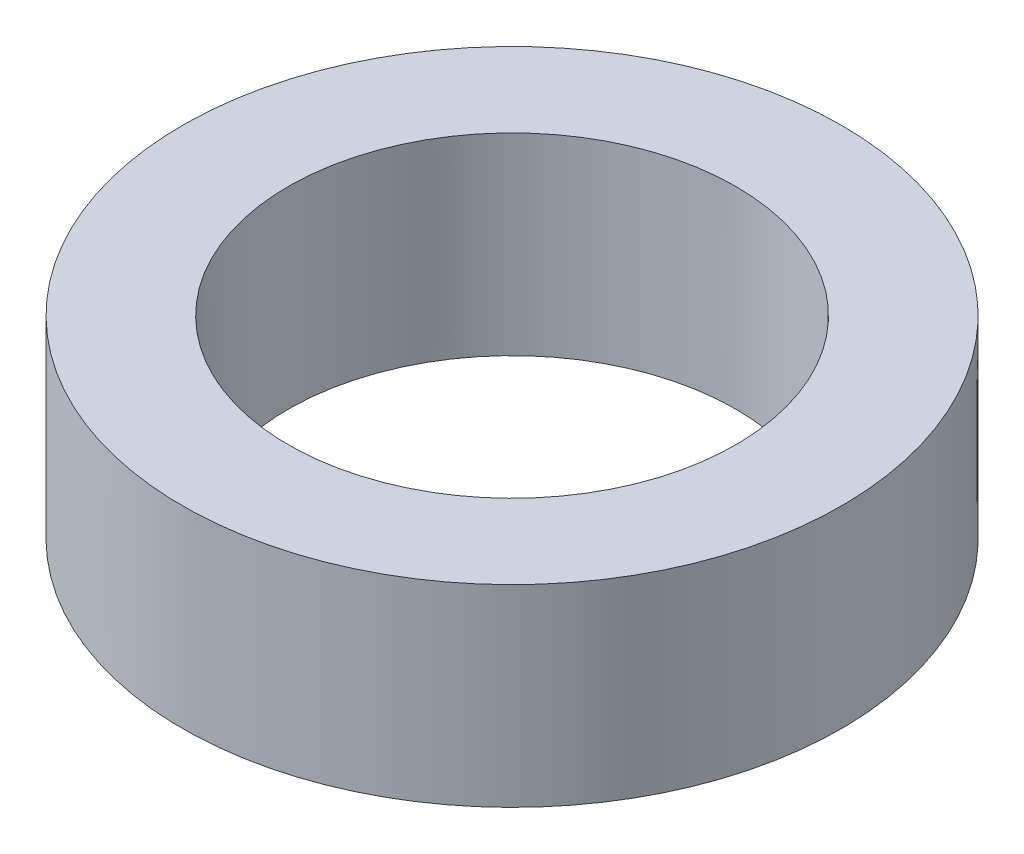
ISO-10303-21;
HEADER;
FILE_DESCRIPTION(('STEP AP214'),'2;1');
FILE_NAME('part.step','',(''),(''),'','','');
FILE_SCHEMA(('AUTOMOTIVE_DESIGN { 1 0 10303 214 1 1 1 1 }'));
ENDSEC;
DATA;
#1=APPLICATION_CONTEXT('core data for automotive mechanical design processes');
#2=APPLICATION_PROTOCOL_DEFINITION('international standard','automotive_design',2000,#1);
#3=PRODUCT_CONTEXT('',#1,'mechanical');
#4=PRODUCT('Part','Part','',(#3));
#5=PRODUCT_RELATED_PRODUCT_CATEGORY('part','',(#4));
#6=PRODUCT_DEFINITION_FORMATION('','',#4);
#7=PRODUCT_DEFINITION_CONTEXT('part definition',#1,'design');
#8=PRODUCT_DEFINITION('design','',#6,#7);
#9=PRODUCT_DEFINITION_SHAPE('','',#8);
#10=(LENGTH_UNIT() NAMED_UNIT(*) SI_UNIT(.MILLI.,.METRE.));
#11=(NAMED_UNIT(*) PLANE_ANGLE_UNIT() SI_UNIT($,.RADIAN.));
#12=(NAMED_UNIT(*) SI_UNIT($,.STERADIAN.) SOLID_ANGLE_UNIT());
#13=UNCERTAINTY_MEASURE_WITH_UNIT(LENGTH_MEASURE(1.E-05),#10,'distance_accuracy_value','');
#14=(GEOMETRIC_REPRESENTATION_CONTEXT(3) GLOBAL_UNCERTAINTY_ASSIGNED_CONTEXT((#13)) GLOBAL_UNIT_ASSIGNED_CONTEXT((#10,
#11,#12)) REPRESENTATION_CONTEXT('',''));
#15=CARTESIAN_POINT('',(0.,0.,0.));
#16=DIRECTION('',(0.,0.,1.));
#17=DIRECTION('',(1.,0.,0.));
#18=AXIS2_PLACEMENT_3D('',#15,#16,#17);
#19=CARTESIAN_POINT('',(0.,0.000589829843522516,0.));
#20=DIRECTION('',(0.,1.,0.));
#21=DIRECTION('',(0.,0.,1.));
#22=AXIS2_PLACEMENT_3D('',#19,#20,#21);
#23=CONICAL_SURFACE('',#22,18.7924204331344,1.57069855014816);
#24=CARTESIAN_POINT('',(0.,0.,0.));
#25=DIRECTION('',(0.,-1.,0.));
#26=DIRECTION('',(0.,0.,-1.));
#27=AXIS2_PLACEMENT_3D('',#24,#25,#26);
#28=CIRCLE('',#27,12.76);
#29=CARTESIAN_POINT('',(0.,0.,-12.76));
#30=VERTEX_POINT('',#29);
#31=EDGE_CURVE('E48',#30,#30,#28,.T.);
#32=ORIENTED_EDGE('',*,*,#31,.F.);
#33=EDGE_LOOP('',(#32));
#34=FACE_BOUND('',#33,.T.);
#35=CARTESIAN_POINT('',(0.,0.000589829843522516,0.));
#36=DIRECTION('',(0.,-1.,0.));
#37=DIRECTION('',(0.,0.,-1.));
#38=AXIS2_PLACEMENT_3D('',#35,#36,#37);
#39=CIRCLE('',#38,18.7924204331344);
#40=CARTESIAN_POINT('',(0.,0.000589829843522516,-18.7924204331344));
#41=VERTEX_POINT('',#40);
#42=EDGE_CURVE('E10',#41,#41,#39,.T.);
#43=ORIENTED_EDGE('',*,*,#42,.T.);
#44=EDGE_LOOP('',(#43));
#45=FACE_BOUND('',#44,.T.);
#46=ADVANCED_FACE('F34',(#34,#45),#23,.T.);
#47=CARTESIAN_POINT('',(0.,11.000589777262,0.));
#48=DIRECTION('',(0.,-1.,0.));
#49=DIRECTION('',(0.,0.,-1.));
#50=AXIS2_PLACEMENT_3D('',#47,#48,#49);
#51=CONICAL_SURFACE('',#50,18.791344890022,9.77766467340069E-05);
#52=ORIENTED_EDGE('',*,*,#42,.F.);
#53=EDGE_LOOP('',(#52));
#54=FACE_BOUND('',#53,.T.);
#55=CARTESIAN_POINT('',(0.,11.000589777262,0.));
#56=DIRECTION('',(0.,-1.,0.));
#57=DIRECTION('',(0.,0.,-1.));
#58=AXIS2_PLACEMENT_3D('',#55,#56,#57);
#59=CIRCLE('',#58,18.791344890022);
#60=CARTESIAN_POINT('',(0.,11.000589777262,-18.791344890022));
#61=VERTEX_POINT('',#60);
#62=EDGE_CURVE('E40',#61,#61,#59,.T.);
#63=ORIENTED_EDGE('',*,*,#62,.T.);
#64=EDGE_LOOP('',(#63));
#65=FACE_BOUND('',#64,.T.);
#66=ADVANCED_FACE('F57',(#54,#65),#51,.T.);
#67=CARTESIAN_POINT('',(0.,10.9999999474185,0.));
#68=DIRECTION('',(0.,1.,0.));
#69=DIRECTION('',(0.,0.,1.));
#70=AXIS2_PLACEMENT_3D('',#67,#68,#69);
#71=CONICAL_SURFACE('',#70,12.7589244568876,1.57069855014822);
#72=ORIENTED_EDGE('',*,*,#62,.F.);
#73=EDGE_LOOP('',(#72));
#74=FACE_BOUND('',#73,.T.);
#75=CARTESIAN_POINT('',(0.,10.9999999474185,0.));
#76=DIRECTION('',(0.,-1.,0.));
#77=DIRECTION('',(0.,0.,-1.));
#78=AXIS2_PLACEMENT_3D('',#75,#76,#77);
#79=CIRCLE('',#78,12.7589244568876);
#80=CARTESIAN_POINT('',(0.,10.9999999474185,-12.7589244568876));
#81=VERTEX_POINT('',#80);
#82=EDGE_CURVE('E44',#81,#81,#79,.T.);
#83=ORIENTED_EDGE('',*,*,#82,.T.);
#84=EDGE_LOOP('',(#83));
#85=FACE_BOUND('',#84,.T.);
#86=ADVANCED_FACE('F61',(#74,#85),#71,.F.);
#87=CARTESIAN_POINT('',(0.,0.,0.));
#88=DIRECTION('',(0.,-1.,0.));
#89=DIRECTION('',(0.,0.,-1.));
#90=AXIS2_PLACEMENT_3D('',#87,#88,#89);
#91=CONICAL_SURFACE('',#90,12.76,9.77766467377917E-05);
#92=ORIENTED_EDGE('',*,*,#82,.F.);
#93=EDGE_LOOP('',(#92));
#94=FACE_BOUND('',#93,.T.);
#95=ORIENTED_EDGE('',*,*,#31,.T.);
#96=EDGE_LOOP('',(#95));
#97=FACE_BOUND('',#96,.T.);
#98=ADVANCED_FACE('F54',(#94,#97),#91,.F.);
#99=CLOSED_SHELL('',(#46,#66,#86,#98));
#100=MANIFOLD_SOLID_BREP('B2',#99);
#101=ADVANCED_BREP_SHAPE_REPRESENTATION('',(#18,#100),#14);
#102=SHAPE_DEFINITION_REPRESENTATION(#9,#101);
ENDSEC;
END-ISO-10303-21;
